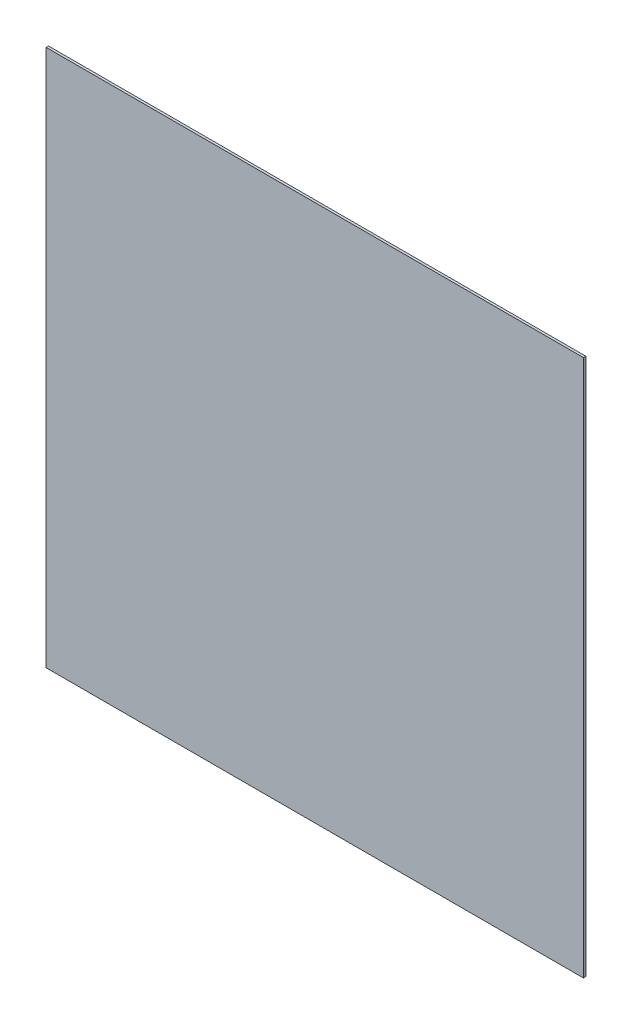
ISO-10303-21;
HEADER;
FILE_DESCRIPTION(('STEP AP214'),'2;1');
FILE_NAME('part.step','',(''),(''),'','','');
FILE_SCHEMA(('AUTOMOTIVE_DESIGN { 1 0 10303 214 1 1 1 1 }'));
ENDSEC;
DATA;
#1=APPLICATION_CONTEXT('core data for automotive mechanical design processes');
#2=APPLICATION_PROTOCOL_DEFINITION('international standard','automotive_design',2000,#1);
#3=PRODUCT_CONTEXT('',#1,'mechanical');
#4=PRODUCT('Part','Part','',(#3));
#5=PRODUCT_RELATED_PRODUCT_CATEGORY('part','',(#4));
#6=PRODUCT_DEFINITION_FORMATION('','',#4);
#7=PRODUCT_DEFINITION_CONTEXT('part definition',#1,'design');
#8=PRODUCT_DEFINITION('design','',#6,#7);
#9=PRODUCT_DEFINITION_SHAPE('','',#8);
#10=(LENGTH_UNIT() NAMED_UNIT(*) SI_UNIT(.MILLI.,.METRE.));
#11=(NAMED_UNIT(*) PLANE_ANGLE_UNIT() SI_UNIT($,.RADIAN.));
#12=(NAMED_UNIT(*) SI_UNIT($,.STERADIAN.) SOLID_ANGLE_UNIT());
#13=UNCERTAINTY_MEASURE_WITH_UNIT(LENGTH_MEASURE(1.E-05),#10,'distance_accuracy_value','');
#14=(GEOMETRIC_REPRESENTATION_CONTEXT(3) GLOBAL_UNCERTAINTY_ASSIGNED_CONTEXT((#13)) GLOBAL_UNIT_ASSIGNED_CONTEXT((#10,
#11,#12)) REPRESENTATION_CONTEXT('',''));
#15=CARTESIAN_POINT('',(0.,0.,0.));
#16=DIRECTION('',(0.,0.,1.));
#17=DIRECTION('',(1.,0.,0.));
#18=AXIS2_PLACEMENT_3D('',#15,#16,#17);
#19=CARTESIAN_POINT('',(0.,0.,4.7625));
#20=DIRECTION('',(1.,0.,0.));
#21=DIRECTION('',(0.,0.,-1.));
#22=AXIS2_PLACEMENT_3D('',#19,#20,#21);
#23=PLANE('',#22);
#24=DIRECTION('',(0.,-1.,0.));
#25=VECTOR('',#24,1.);
#26=CARTESIAN_POINT('',(0.,0.,0.));
#27=LINE('',#26,#25);
#28=CARTESIAN_POINT('',(0.,0.,0.));
#29=VERTEX_POINT('',#28);
#30=CARTESIAN_POINT('',(0.,-1066.8,0.));
#31=VERTEX_POINT('',#30);
#32=EDGE_CURVE('E97',#29,#31,#27,.T.);
#33=ORIENTED_EDGE('',*,*,#32,.T.);
#34=DIRECTION('',(0.,0.,-1.));
#35=VECTOR('',#34,1.);
#36=CARTESIAN_POINT('',(0.,-1066.8,4.7625));
#37=LINE('',#36,#35);
#38=CARTESIAN_POINT('',(0.,-1066.8,4.7625));
#39=VERTEX_POINT('',#38);
#40=EDGE_CURVE('E11',#39,#31,#37,.T.);
#41=ORIENTED_EDGE('',*,*,#40,.F.);
#42=DIRECTION('',(0.,-1.,0.));
#43=VECTOR('',#42,1.);
#44=CARTESIAN_POINT('',(0.,0.,4.7625));
#45=LINE('',#44,#43);
#46=CARTESIAN_POINT('',(0.,0.,4.7625));
#47=VERTEX_POINT('',#46);
#48=EDGE_CURVE('E83',#47,#39,#45,.T.);
#49=ORIENTED_EDGE('',*,*,#48,.F.);
#50=DIRECTION('',(0.,0.,-1.));
#51=VECTOR('',#50,1.);
#52=CARTESIAN_POINT('',(0.,0.,4.7625));
#53=LINE('',#52,#51);
#54=EDGE_CURVE('E50',#47,#29,#53,.T.);
#55=ORIENTED_EDGE('',*,*,#54,.T.);
#56=EDGE_LOOP('',(#33,#41,#49,#55));
#57=FACE_BOUND('',#56,.T.);
#58=ADVANCED_FACE('F34',(#57),#23,.F.);
#59=CARTESIAN_POINT('',(-2.22044604925031E-13,-1066.8,4.7625));
#60=DIRECTION('',(0.,1.,0.));
#61=DIRECTION('',(-1.,0.,0.));
#62=AXIS2_PLACEMENT_3D('',#59,#60,#61);
#63=PLANE('',#62);
#64=DIRECTION('',(1.,0.,0.));
#65=VECTOR('',#64,1.);
#66=CARTESIAN_POINT('',(-2.22044604925031E-13,-1066.8,0.));
#67=LINE('',#66,#65);
#68=CARTESIAN_POINT('',(1066.8,-1066.8,0.));
#69=VERTEX_POINT('',#68);
#70=EDGE_CURVE('E88',#31,#69,#67,.T.);
#71=ORIENTED_EDGE('',*,*,#70,.T.);
#72=DIRECTION('',(0.,0.,-1.));
#73=VECTOR('',#72,1.);
#74=CARTESIAN_POINT('',(1066.8,-1066.8,4.7625));
#75=LINE('',#74,#73);
#76=CARTESIAN_POINT('',(1066.8,-1066.8,4.7625));
#77=VERTEX_POINT('',#76);
#78=EDGE_CURVE('E42',#77,#69,#75,.T.);
#79=ORIENTED_EDGE('',*,*,#78,.F.);
#80=DIRECTION('',(1.,0.,0.));
#81=VECTOR('',#80,1.);
#82=CARTESIAN_POINT('',(-2.22044604925031E-13,-1066.8,4.7625));
#83=LINE('',#82,#81);
#84=EDGE_CURVE('E75',#39,#77,#83,.T.);
#85=ORIENTED_EDGE('',*,*,#84,.F.);
#86=ORIENTED_EDGE('',*,*,#40,.T.);
#87=EDGE_LOOP('',(#71,#79,#85,#86));
#88=FACE_BOUND('',#87,.T.);
#89=ADVANCED_FACE('F87',(#88),#63,.F.);
#90=CARTESIAN_POINT('',(1066.8,2.22044604925031E-13,4.7625));
#91=DIRECTION('',(1.,0.,0.));
#92=DIRECTION('',(0.,1.,0.));
#93=AXIS2_PLACEMENT_3D('',#90,#91,#92);
#94=PLANE('',#93);
#95=DIRECTION('',(0.,-1.,0.));
#96=VECTOR('',#95,1.);
#97=CARTESIAN_POINT('',(1066.8,2.22044604925031E-13,0.));
#98=LINE('',#97,#96);
#99=CARTESIAN_POINT('',(1066.8,0.,0.));
#100=VERTEX_POINT('',#99);
#101=EDGE_CURVE('E100',#100,#69,#98,.T.);
#102=ORIENTED_EDGE('',*,*,#101,.F.);
#103=DIRECTION('',(0.,0.,-1.));
#104=VECTOR('',#103,1.);
#105=CARTESIAN_POINT('',(1066.8,0.,4.7625));
#106=LINE('',#105,#104);
#107=CARTESIAN_POINT('',(1066.8,0.,4.7625));
#108=VERTEX_POINT('',#107);
#109=EDGE_CURVE('E64',#108,#100,#106,.T.);
#110=ORIENTED_EDGE('',*,*,#109,.F.);
#111=DIRECTION('',(0.,-1.,0.));
#112=VECTOR('',#111,1.);
#113=CARTESIAN_POINT('',(1066.8,2.22044604925031E-13,4.7625));
#114=LINE('',#113,#112);
#115=EDGE_CURVE('E82',#108,#77,#114,.T.);
#116=ORIENTED_EDGE('',*,*,#115,.T.);
#117=ORIENTED_EDGE('',*,*,#78,.T.);
#118=EDGE_LOOP('',(#102,#110,#116,#117));
#119=FACE_BOUND('',#118,.T.);
#120=ADVANCED_FACE('F91',(#119),#94,.T.);
#121=CARTESIAN_POINT('',(0.,0.,4.7625));
#122=DIRECTION('',(0.,1.,0.));
#123=DIRECTION('',(0.,0.,1.));
#124=AXIS2_PLACEMENT_3D('',#121,#122,#123);
#125=PLANE('',#124);
#126=DIRECTION('',(1.,0.,0.));
#127=VECTOR('',#126,1.);
#128=CARTESIAN_POINT('',(0.,0.,0.));
#129=LINE('',#128,#127);
#130=EDGE_CURVE('E102',#29,#100,#129,.T.);
#131=ORIENTED_EDGE('',*,*,#130,.F.);
#132=ORIENTED_EDGE('',*,*,#54,.F.);
#133=DIRECTION('',(1.,0.,0.));
#134=VECTOR('',#133,1.);
#135=CARTESIAN_POINT('',(0.,0.,4.7625));
#136=LINE('',#135,#134);
#137=EDGE_CURVE('E92',#47,#108,#136,.T.);
#138=ORIENTED_EDGE('',*,*,#137,.T.);
#139=ORIENTED_EDGE('',*,*,#109,.T.);
#140=EDGE_LOOP('',(#131,#132,#138,#139));
#141=FACE_BOUND('',#140,.T.);
#142=ADVANCED_FACE('F108',(#141),#125,.T.);
#143=CARTESIAN_POINT('',(0.,0.,4.7625));
#144=DIRECTION('',(0.,0.,1.));
#145=DIRECTION('',(1.,0.,0.));
#146=AXIS2_PLACEMENT_3D('',#143,#144,#145);
#147=PLANE('',#146);
#148=ORIENTED_EDGE('',*,*,#48,.T.);
#149=ORIENTED_EDGE('',*,*,#84,.T.);
#150=ORIENTED_EDGE('',*,*,#115,.F.);
#151=ORIENTED_EDGE('',*,*,#137,.F.);
#152=EDGE_LOOP('',(#148,#149,#150,#151));
#153=FACE_BOUND('',#152,.T.);
#154=ADVANCED_FACE('F79',(#153),#147,.T.);
#155=CARTESIAN_POINT('',(0.,0.,0.));
#156=DIRECTION('',(0.,0.,1.));
#157=DIRECTION('',(1.,0.,0.));
#158=AXIS2_PLACEMENT_3D('',#155,#156,#157);
#159=PLANE('',#158);
#160=ORIENTED_EDGE('',*,*,#32,.F.);
#161=ORIENTED_EDGE('',*,*,#130,.T.);
#162=ORIENTED_EDGE('',*,*,#101,.T.);
#163=ORIENTED_EDGE('',*,*,#70,.F.);
#164=EDGE_LOOP('',(#160,#161,#162,#163));
#165=FACE_BOUND('',#164,.T.);
#166=ADVANCED_FACE('F107',(#165),#159,.F.);
#167=CLOSED_SHELL('',(#58,#89,#120,#142,#154,#166));
#168=MANIFOLD_SOLID_BREP('B2',#167);
#169=ADVANCED_BREP_SHAPE_REPRESENTATION('',(#18,#168),#14);
#170=SHAPE_DEFINITION_REPRESENTATION(#9,#169);
ENDSEC;
END-ISO-10303-21;
